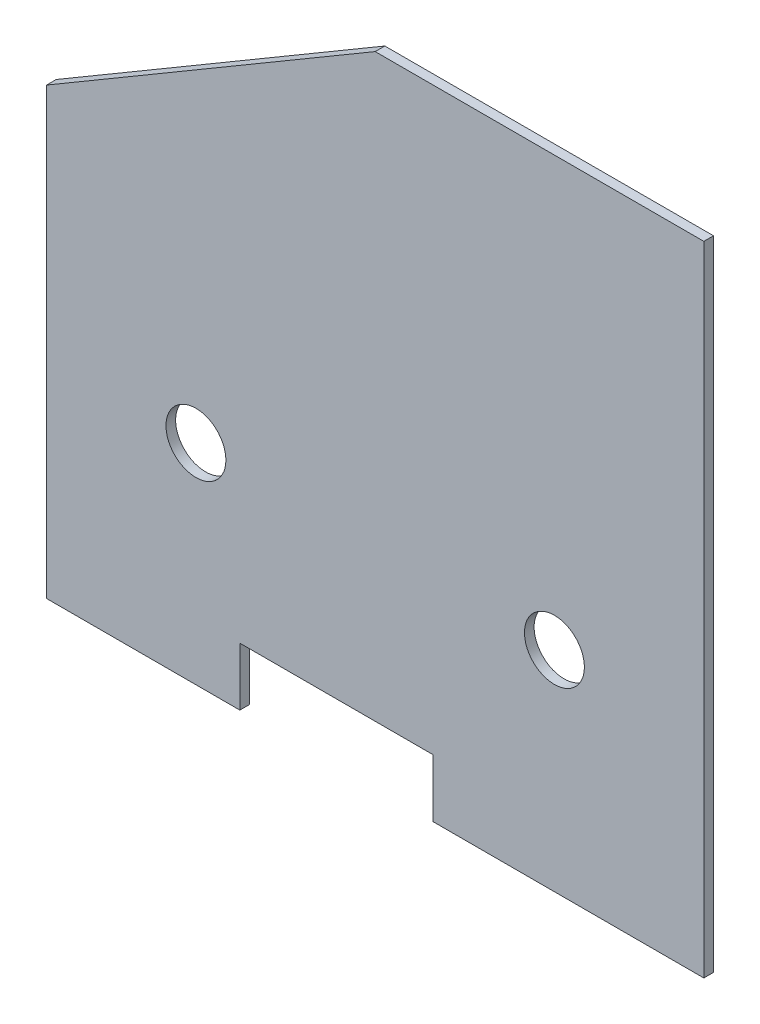
ISO-10303-21;
HEADER;
FILE_DESCRIPTION(('STEP AP214'),'2;1');
FILE_NAME('part.step','',(''),(''),'','','');
FILE_SCHEMA(('AUTOMOTIVE_DESIGN { 1 0 10303 214 1 1 1 1 }'));
ENDSEC;
DATA;
#1=APPLICATION_CONTEXT('core data for automotive mechanical design processes');
#2=APPLICATION_PROTOCOL_DEFINITION('international standard','automotive_design',2000,#1);
#3=PRODUCT_CONTEXT('',#1,'mechanical');
#4=PRODUCT('Part','Part','',(#3));
#5=PRODUCT_RELATED_PRODUCT_CATEGORY('part','',(#4));
#6=PRODUCT_DEFINITION_FORMATION('','',#4);
#7=PRODUCT_DEFINITION_CONTEXT('part definition',#1,'design');
#8=PRODUCT_DEFINITION('design','',#6,#7);
#9=PRODUCT_DEFINITION_SHAPE('','',#8);
#10=(LENGTH_UNIT() NAMED_UNIT(*) SI_UNIT(.MILLI.,.METRE.));
#11=(NAMED_UNIT(*) PLANE_ANGLE_UNIT() SI_UNIT($,.RADIAN.));
#12=(NAMED_UNIT(*) SI_UNIT($,.STERADIAN.) SOLID_ANGLE_UNIT());
#13=UNCERTAINTY_MEASURE_WITH_UNIT(LENGTH_MEASURE(1.E-05),#10,'distance_accuracy_value','');
#14=(GEOMETRIC_REPRESENTATION_CONTEXT(3) GLOBAL_UNCERTAINTY_ASSIGNED_CONTEXT((#13)) GLOBAL_UNIT_ASSIGNED_CONTEXT((#10,
#11,#12)) REPRESENTATION_CONTEXT('',''));
#15=CARTESIAN_POINT('',(0.,0.,0.));
#16=DIRECTION('',(0.,0.,1.));
#17=DIRECTION('',(1.,0.,0.));
#18=AXIS2_PLACEMENT_3D('',#15,#16,#17);
#19=CARTESIAN_POINT('',(431.8,12.7,6.35));
#20=DIRECTION('',(-1.,0.,0.));
#21=DIRECTION('',(0.,-1.,0.));
#22=AXIS2_PLACEMENT_3D('',#19,#20,#21);
#23=PLANE('',#22);
#24=DIRECTION('',(0.,1.,0.));
#25=VECTOR('',#24,1.);
#26=CARTESIAN_POINT('',(431.8,12.7,0.));
#27=LINE('',#26,#25);
#28=CARTESIAN_POINT('',(431.8,12.7,0.));
#29=VERTEX_POINT('',#28);
#30=CARTESIAN_POINT('',(431.8,431.8,0.));
#31=VERTEX_POINT('',#30);
#32=EDGE_CURVE('E137',#29,#31,#27,.T.);
#33=ORIENTED_EDGE('',*,*,#32,.T.);
#34=DIRECTION('',(0.,0.,-1.));
#35=VECTOR('',#34,1.);
#36=CARTESIAN_POINT('',(431.8,431.8,6.35));
#37=LINE('',#36,#35);
#38=CARTESIAN_POINT('',(431.8,431.8,6.35));
#39=VERTEX_POINT('',#38);
#40=EDGE_CURVE('E11',#39,#31,#37,.T.);
#41=ORIENTED_EDGE('',*,*,#40,.F.);
#42=DIRECTION('',(0.,1.,0.));
#43=VECTOR('',#42,1.);
#44=CARTESIAN_POINT('',(431.8,12.7,6.35));
#45=LINE('',#44,#43);
#46=CARTESIAN_POINT('',(431.8,12.7,6.35));
#47=VERTEX_POINT('',#46);
#48=EDGE_CURVE('E154',#47,#39,#45,.T.);
#49=ORIENTED_EDGE('',*,*,#48,.F.);
#50=DIRECTION('',(0.,0.,-1.));
#51=VECTOR('',#50,1.);
#52=CARTESIAN_POINT('',(431.8,12.7,6.35));
#53=LINE('',#52,#51);
#54=EDGE_CURVE('E133',#47,#29,#53,.T.);
#55=ORIENTED_EDGE('',*,*,#54,.T.);
#56=EDGE_LOOP('',(#33,#41,#49,#55));
#57=FACE_BOUND('',#56,.T.);
#58=ADVANCED_FACE('F35',(#57),#23,.F.);
#59=CARTESIAN_POINT('',(215.9,431.8,6.35));
#60=DIRECTION('',(0.,-1.,0.));
#61=DIRECTION('',(0.,0.,-1.));
#62=AXIS2_PLACEMENT_3D('',#59,#60,#61);
#63=PLANE('',#62);
#64=DIRECTION('',(-1.,0.,0.));
#65=VECTOR('',#64,1.);
#66=CARTESIAN_POINT('',(215.9,431.8,0.));
#67=LINE('',#66,#65);
#68=CARTESIAN_POINT('',(215.9,431.8,0.));
#69=VERTEX_POINT('',#68);
#70=EDGE_CURVE('E140',#31,#69,#67,.T.);
#71=ORIENTED_EDGE('',*,*,#70,.T.);
#72=DIRECTION('',(0.,0.,-1.));
#73=VECTOR('',#72,1.);
#74=CARTESIAN_POINT('',(215.9,431.8,6.35));
#75=LINE('',#74,#73);
#76=CARTESIAN_POINT('',(215.9,431.8,6.35));
#77=VERTEX_POINT('',#76);
#78=EDGE_CURVE('E43',#77,#69,#75,.T.);
#79=ORIENTED_EDGE('',*,*,#78,.F.);
#80=DIRECTION('',(-1.,0.,0.));
#81=VECTOR('',#80,1.);
#82=CARTESIAN_POINT('',(215.9,431.8,6.35));
#83=LINE('',#82,#81);
#84=EDGE_CURVE('E97',#39,#77,#83,.T.);
#85=ORIENTED_EDGE('',*,*,#84,.F.);
#86=ORIENTED_EDGE('',*,*,#40,.T.);
#87=EDGE_LOOP('',(#71,#79,#85,#86));
#88=FACE_BOUND('',#87,.T.);
#89=ADVANCED_FACE('F232',(#88),#63,.F.);
#90=CARTESIAN_POINT('',(0.,304.8,6.35));
#91=DIRECTION('',(0.507020126563394,-0.861934215157769,0.));
#92=DIRECTION('',(0.86193421515777,0.507020126563394,0.));
#93=AXIS2_PLACEMENT_3D('',#90,#91,#92);
#94=PLANE('',#93);
#95=DIRECTION('',(-0.861934215157769,-0.507020126563394,0.));
#96=VECTOR('',#95,1.);
#97=CARTESIAN_POINT('',(0.,304.8,0.));
#98=LINE('',#97,#96);
#99=CARTESIAN_POINT('',(0.,304.8,0.));
#100=VERTEX_POINT('',#99);
#101=EDGE_CURVE('E143',#69,#100,#98,.T.);
#102=ORIENTED_EDGE('',*,*,#101,.T.);
#103=DIRECTION('',(0.,0.,-1.));
#104=VECTOR('',#103,1.);
#105=CARTESIAN_POINT('',(0.,304.8,6.35));
#106=LINE('',#105,#104);
#107=CARTESIAN_POINT('',(0.,304.8,6.35));
#108=VERTEX_POINT('',#107);
#109=EDGE_CURVE('E164',#108,#100,#106,.T.);
#110=ORIENTED_EDGE('',*,*,#109,.F.);
#111=DIRECTION('',(-0.861934215157769,-0.507020126563394,0.));
#112=VECTOR('',#111,1.);
#113=CARTESIAN_POINT('',(0.,304.8,6.35));
#114=LINE('',#113,#112);
#115=EDGE_CURVE('E172',#77,#108,#114,.T.);
#116=ORIENTED_EDGE('',*,*,#115,.F.);
#117=ORIENTED_EDGE('',*,*,#78,.T.);
#118=EDGE_LOOP('',(#102,#110,#116,#117));
#119=FACE_BOUND('',#118,.T.);
#120=ADVANCED_FACE('F170',(#119),#94,.F.);
#121=CARTESIAN_POINT('',(0.,304.8,6.35));
#122=DIRECTION('',(1.,0.,0.));
#123=DIRECTION('',(0.,1.,0.));
#124=AXIS2_PLACEMENT_3D('',#121,#122,#123);
#125=PLANE('',#124);
#126=DIRECTION('',(0.,-1.,0.));
#127=VECTOR('',#126,1.);
#128=CARTESIAN_POINT('',(0.,304.8,0.));
#129=LINE('',#128,#127);
#130=CARTESIAN_POINT('',(0.,12.7,0.));
#131=VERTEX_POINT('',#130);
#132=EDGE_CURVE('E145',#100,#131,#129,.T.);
#133=ORIENTED_EDGE('',*,*,#132,.T.);
#134=DIRECTION('',(0.,0.,-1.));
#135=VECTOR('',#134,1.);
#136=CARTESIAN_POINT('',(0.,12.7,6.35));
#137=LINE('',#136,#135);
#138=CARTESIAN_POINT('',(0.,12.7,6.35));
#139=VERTEX_POINT('',#138);
#140=EDGE_CURVE('E161',#139,#131,#137,.T.);
#141=ORIENTED_EDGE('',*,*,#140,.F.);
#142=DIRECTION('',(0.,-1.,0.));
#143=VECTOR('',#142,1.);
#144=CARTESIAN_POINT('',(0.,304.8,6.35));
#145=LINE('',#144,#143);
#146=EDGE_CURVE('E188',#108,#139,#145,.T.);
#147=ORIENTED_EDGE('',*,*,#146,.F.);
#148=ORIENTED_EDGE('',*,*,#109,.T.);
#149=EDGE_LOOP('',(#133,#141,#147,#148));
#150=FACE_BOUND('',#149,.T.);
#151=ADVANCED_FACE('F181',(#150),#125,.F.);
#152=CARTESIAN_POINT('',(0.,12.7,6.35));
#153=DIRECTION('',(0.,1.,0.));
#154=DIRECTION('',(-1.,0.,0.));
#155=AXIS2_PLACEMENT_3D('',#152,#153,#154);
#156=PLANE('',#155);
#157=DIRECTION('',(1.,0.,0.));
#158=VECTOR('',#157,1.);
#159=CARTESIAN_POINT('',(0.,12.7,0.));
#160=LINE('',#159,#158);
#161=CARTESIAN_POINT('',(127.,12.7,0.));
#162=VERTEX_POINT('',#161);
#163=EDGE_CURVE('E147',#131,#162,#160,.T.);
#164=ORIENTED_EDGE('',*,*,#163,.T.);
#165=DIRECTION('',(0.,0.,-1.));
#166=VECTOR('',#165,1.);
#167=CARTESIAN_POINT('',(127.,12.7,6.35));
#168=LINE('',#167,#166);
#169=CARTESIAN_POINT('',(127.,12.7,6.35));
#170=VERTEX_POINT('',#169);
#171=EDGE_CURVE('E158',#170,#162,#168,.T.);
#172=ORIENTED_EDGE('',*,*,#171,.F.);
#173=DIRECTION('',(1.,0.,0.));
#174=VECTOR('',#173,1.);
#175=CARTESIAN_POINT('',(0.,12.7,6.35));
#176=LINE('',#175,#174);
#177=EDGE_CURVE('E187',#139,#170,#176,.T.);
#178=ORIENTED_EDGE('',*,*,#177,.F.);
#179=ORIENTED_EDGE('',*,*,#140,.T.);
#180=EDGE_LOOP('',(#164,#172,#178,#179));
#181=FACE_BOUND('',#180,.T.);
#182=ADVANCED_FACE('F185',(#181),#156,.F.);
#183=CARTESIAN_POINT('',(127.,12.7,6.35));
#184=DIRECTION('',(-1.,0.,0.));
#185=DIRECTION('',(0.,0.,1.));
#186=AXIS2_PLACEMENT_3D('',#183,#184,#185);
#187=PLANE('',#186);
#188=DIRECTION('',(0.,1.,0.));
#189=VECTOR('',#188,1.);
#190=CARTESIAN_POINT('',(127.,12.7,0.));
#191=LINE('',#190,#189);
#192=CARTESIAN_POINT('',(127.,50.8,0.));
#193=VERTEX_POINT('',#192);
#194=EDGE_CURVE('E149',#162,#193,#191,.T.);
#195=ORIENTED_EDGE('',*,*,#194,.T.);
#196=DIRECTION('',(0.,0.,-1.));
#197=VECTOR('',#196,1.);
#198=CARTESIAN_POINT('',(127.,50.8,6.35));
#199=LINE('',#198,#197);
#200=CARTESIAN_POINT('',(127.,50.8,6.35));
#201=VERTEX_POINT('',#200);
#202=EDGE_CURVE('E128',#201,#193,#199,.T.);
#203=ORIENTED_EDGE('',*,*,#202,.F.);
#204=DIRECTION('',(0.,1.,0.));
#205=VECTOR('',#204,1.);
#206=CARTESIAN_POINT('',(127.,12.7,6.35));
#207=LINE('',#206,#205);
#208=EDGE_CURVE('E119',#170,#201,#207,.T.);
#209=ORIENTED_EDGE('',*,*,#208,.F.);
#210=ORIENTED_EDGE('',*,*,#171,.T.);
#211=EDGE_LOOP('',(#195,#203,#209,#210));
#212=FACE_BOUND('',#211,.T.);
#213=ADVANCED_FACE('F240',(#212),#187,.F.);
#214=CARTESIAN_POINT('',(254.,50.8,6.35));
#215=DIRECTION('',(0.,1.,0.));
#216=DIRECTION('',(-1.,0.,0.));
#217=AXIS2_PLACEMENT_3D('',#214,#215,#216);
#218=PLANE('',#217);
#219=DIRECTION('',(1.,0.,0.));
#220=VECTOR('',#219,1.);
#221=CARTESIAN_POINT('',(254.,50.8,0.));
#222=LINE('',#221,#220);
#223=CARTESIAN_POINT('',(254.,50.8,0.));
#224=VERTEX_POINT('',#223);
#225=EDGE_CURVE('E127',#193,#224,#222,.T.);
#226=ORIENTED_EDGE('',*,*,#225,.T.);
#227=DIRECTION('',(0.,0.,-1.));
#228=VECTOR('',#227,1.);
#229=CARTESIAN_POINT('',(254.,50.8,6.35));
#230=LINE('',#229,#228);
#231=CARTESIAN_POINT('',(254.,50.8,6.35));
#232=VERTEX_POINT('',#231);
#233=EDGE_CURVE('E124',#232,#224,#230,.T.);
#234=ORIENTED_EDGE('',*,*,#233,.F.);
#235=DIRECTION('',(1.,0.,0.));
#236=VECTOR('',#235,1.);
#237=CARTESIAN_POINT('',(254.,50.8,6.35));
#238=LINE('',#237,#236);
#239=EDGE_CURVE('E113',#201,#232,#238,.T.);
#240=ORIENTED_EDGE('',*,*,#239,.F.);
#241=ORIENTED_EDGE('',*,*,#202,.T.);
#242=EDGE_LOOP('',(#226,#234,#240,#241));
#243=FACE_BOUND('',#242,.T.);
#244=ADVANCED_FACE('F125',(#243),#218,.F.);
#245=CARTESIAN_POINT('',(254.,50.8,6.35));
#246=DIRECTION('',(1.,0.,0.));
#247=DIRECTION('',(0.,1.,0.));
#248=AXIS2_PLACEMENT_3D('',#245,#246,#247);
#249=PLANE('',#248);
#250=DIRECTION('',(0.,-1.,0.));
#251=VECTOR('',#250,1.);
#252=CARTESIAN_POINT('',(254.,50.8,0.));
#253=LINE('',#252,#251);
#254=CARTESIAN_POINT('',(254.,12.7,0.));
#255=VERTEX_POINT('',#254);
#256=EDGE_CURVE('E83',#224,#255,#253,.T.);
#257=ORIENTED_EDGE('',*,*,#256,.T.);
#258=DIRECTION('',(0.,0.,-1.));
#259=VECTOR('',#258,1.);
#260=CARTESIAN_POINT('',(254.,12.7,6.35));
#261=LINE('',#260,#259);
#262=CARTESIAN_POINT('',(254.,12.7,6.35));
#263=VERTEX_POINT('',#262);
#264=EDGE_CURVE('E129',#263,#255,#261,.T.);
#265=ORIENTED_EDGE('',*,*,#264,.F.);
#266=DIRECTION('',(0.,-1.,0.));
#267=VECTOR('',#266,1.);
#268=CARTESIAN_POINT('',(254.,50.8,6.35));
#269=LINE('',#268,#267);
#270=EDGE_CURVE('E117',#232,#263,#269,.T.);
#271=ORIENTED_EDGE('',*,*,#270,.F.);
#272=ORIENTED_EDGE('',*,*,#233,.T.);
#273=EDGE_LOOP('',(#257,#265,#271,#272));
#274=FACE_BOUND('',#273,.T.);
#275=ADVANCED_FACE('F131',(#274),#249,.F.);
#276=CARTESIAN_POINT('',(254.,12.7,6.35));
#277=DIRECTION('',(0.,1.,0.));
#278=DIRECTION('',(-1.,0.,0.));
#279=AXIS2_PLACEMENT_3D('',#276,#277,#278);
#280=PLANE('',#279);
#281=DIRECTION('',(1.,0.,0.));
#282=VECTOR('',#281,1.);
#283=CARTESIAN_POINT('',(254.,12.7,0.));
#284=LINE('',#283,#282);
#285=EDGE_CURVE('E89',#255,#29,#284,.T.);
#286=ORIENTED_EDGE('',*,*,#285,.T.);
#287=ORIENTED_EDGE('',*,*,#54,.F.);
#288=DIRECTION('',(1.,0.,0.));
#289=VECTOR('',#288,1.);
#290=CARTESIAN_POINT('',(254.,12.7,6.35));
#291=LINE('',#290,#289);
#292=EDGE_CURVE('E51',#263,#47,#291,.T.);
#293=ORIENTED_EDGE('',*,*,#292,.F.);
#294=ORIENTED_EDGE('',*,*,#264,.T.);
#295=EDGE_LOOP('',(#286,#287,#293,#294));
#296=FACE_BOUND('',#295,.T.);
#297=ADVANCED_FACE('F218',(#296),#280,.F.);
#298=CARTESIAN_POINT('',(0.,0.,6.35));
#299=DIRECTION('',(0.,0.,-1.));
#300=DIRECTION('',(-1.,0.,0.));
#301=AXIS2_PLACEMENT_3D('',#298,#299,#300);
#302=PLANE('',#301);
#303=CARTESIAN_POINT('',(333.65,150.3,6.35));
#304=DIRECTION('',(0.,0.,1.));
#305=DIRECTION('',(1.,0.,0.));
#306=AXIS2_PLACEMENT_3D('',#303,#304,#305);
#307=CIRCLE('',#306,19.685);
#308=CARTESIAN_POINT('',(353.335,150.3,6.35));
#309=VERTEX_POINT('',#308);
#310=EDGE_CURVE('E201',#309,#309,#307,.T.);
#311=ORIENTED_EDGE('',*,*,#310,.F.);
#312=EDGE_LOOP('',(#311));
#313=FACE_BOUND('',#312,.T.);
#314=CARTESIAN_POINT('',(98.15,150.3,6.35));
#315=DIRECTION('',(0.,0.,1.));
#316=DIRECTION('',(1.,0.,0.));
#317=AXIS2_PLACEMENT_3D('',#314,#315,#316);
#318=CIRCLE('',#317,19.685);
#319=CARTESIAN_POINT('',(117.835,150.3,6.35));
#320=VERTEX_POINT('',#319);
#321=EDGE_CURVE('E195',#320,#320,#318,.T.);
#322=ORIENTED_EDGE('',*,*,#321,.F.);
#323=EDGE_LOOP('',(#322));
#324=FACE_BOUND('',#323,.T.);
#325=ORIENTED_EDGE('',*,*,#48,.T.);
#326=ORIENTED_EDGE('',*,*,#84,.T.);
#327=ORIENTED_EDGE('',*,*,#115,.T.);
#328=ORIENTED_EDGE('',*,*,#146,.T.);
#329=ORIENTED_EDGE('',*,*,#177,.T.);
#330=ORIENTED_EDGE('',*,*,#208,.T.);
#331=ORIENTED_EDGE('',*,*,#239,.T.);
#332=ORIENTED_EDGE('',*,*,#270,.T.);
#333=ORIENTED_EDGE('',*,*,#292,.T.);
#334=EDGE_LOOP('',(#325,#326,#327,#328,#329,#330,#331,#332,#333));
#335=FACE_BOUND('',#334,.T.);
#336=ADVANCED_FACE('F115',(#313,#324,#335),#302,.F.);
#337=CARTESIAN_POINT('',(0.,0.,0.));
#338=DIRECTION('',(0.,0.,-1.));
#339=DIRECTION('',(-1.,0.,0.));
#340=AXIS2_PLACEMENT_3D('',#337,#338,#339);
#341=PLANE('',#340);
#342=CARTESIAN_POINT('',(333.65,150.3,0.));
#343=DIRECTION('',(0.,0.,1.));
#344=DIRECTION('',(1.,0.,0.));
#345=AXIS2_PLACEMENT_3D('',#342,#343,#344);
#346=CIRCLE('',#345,19.685);
#347=CARTESIAN_POINT('',(353.335,150.3,0.));
#348=VERTEX_POINT('',#347);
#349=EDGE_CURVE('E198',#348,#348,#346,.T.);
#350=ORIENTED_EDGE('',*,*,#349,.T.);
#351=EDGE_LOOP('',(#350));
#352=FACE_BOUND('',#351,.T.);
#353=CARTESIAN_POINT('',(98.15,150.3,0.));
#354=DIRECTION('',(0.,0.,1.));
#355=DIRECTION('',(1.,0.,0.));
#356=AXIS2_PLACEMENT_3D('',#353,#354,#355);
#357=CIRCLE('',#356,19.685);
#358=CARTESIAN_POINT('',(117.835,150.3,0.));
#359=VERTEX_POINT('',#358);
#360=EDGE_CURVE('E141',#359,#359,#357,.T.);
#361=ORIENTED_EDGE('',*,*,#360,.T.);
#362=EDGE_LOOP('',(#361));
#363=FACE_BOUND('',#362,.T.);
#364=ORIENTED_EDGE('',*,*,#32,.F.);
#365=ORIENTED_EDGE('',*,*,#285,.F.);
#366=ORIENTED_EDGE('',*,*,#256,.F.);
#367=ORIENTED_EDGE('',*,*,#225,.F.);
#368=ORIENTED_EDGE('',*,*,#194,.F.);
#369=ORIENTED_EDGE('',*,*,#163,.F.);
#370=ORIENTED_EDGE('',*,*,#132,.F.);
#371=ORIENTED_EDGE('',*,*,#101,.F.);
#372=ORIENTED_EDGE('',*,*,#70,.F.);
#373=EDGE_LOOP('',(#364,#365,#366,#367,#368,#369,#370,#371,#372));
#374=FACE_BOUND('',#373,.T.);
#375=ADVANCED_FACE('F176',(#352,#363,#374),#341,.T.);
#376=CARTESIAN_POINT('',(98.15,150.3,0.));
#377=DIRECTION('',(0.,0.,1.));
#378=DIRECTION('',(1.,0.,0.));
#379=AXIS2_PLACEMENT_3D('',#376,#377,#378);
#380=CYLINDRICAL_SURFACE('',#379,19.685);
#381=ORIENTED_EDGE('',*,*,#360,.F.);
#382=EDGE_LOOP('',(#381));
#383=FACE_BOUND('',#382,.T.);
#384=ORIENTED_EDGE('',*,*,#321,.T.);
#385=EDGE_LOOP('',(#384));
#386=FACE_BOUND('',#385,.T.);
#387=ADVANCED_FACE('F212',(#383,#386),#380,.F.);
#388=CARTESIAN_POINT('',(333.65,150.3,0.));
#389=DIRECTION('',(0.,0.,1.));
#390=DIRECTION('',(1.,0.,0.));
#391=AXIS2_PLACEMENT_3D('',#388,#389,#390);
#392=CYLINDRICAL_SURFACE('',#391,19.685);
#393=ORIENTED_EDGE('',*,*,#349,.F.);
#394=EDGE_LOOP('',(#393));
#395=FACE_BOUND('',#394,.T.);
#396=ORIENTED_EDGE('',*,*,#310,.T.);
#397=EDGE_LOOP('',(#396));
#398=FACE_BOUND('',#397,.T.);
#399=ADVANCED_FACE('F209',(#395,#398),#392,.F.);
#400=CLOSED_SHELL('',(#58,#89,#120,#151,#182,#213,#244,#275,#297,#336,#375,#387,#399));
#401=MANIFOLD_SOLID_BREP('B2',#400);
#402=ADVANCED_BREP_SHAPE_REPRESENTATION('',(#18,#401),#14);
#403=SHAPE_DEFINITION_REPRESENTATION(#9,#402);
ENDSEC;
END-ISO-10303-21;
